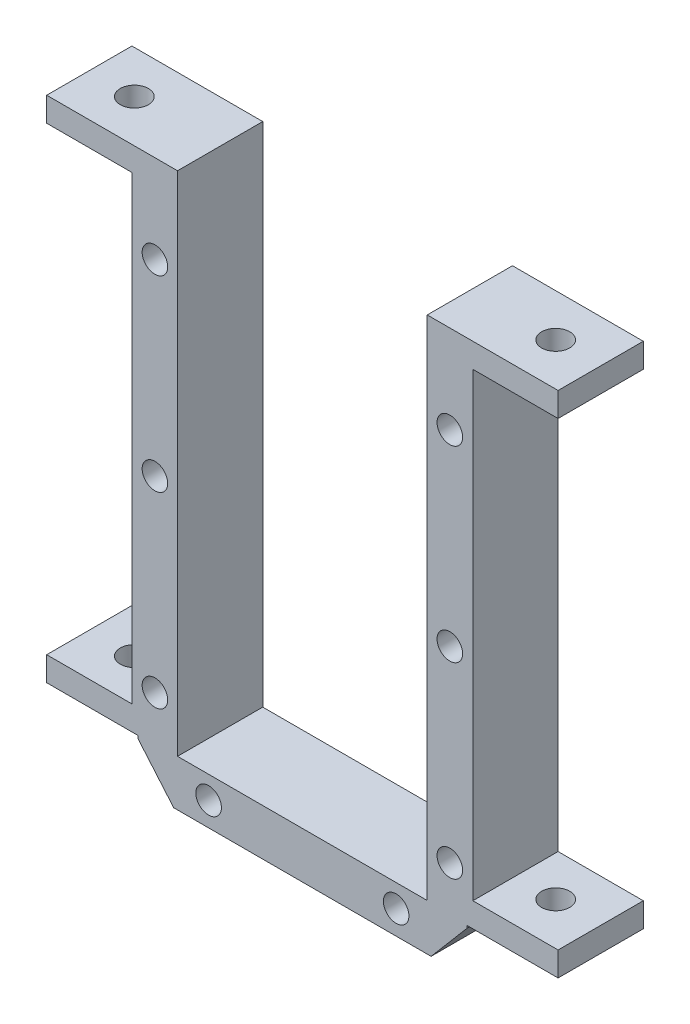
ISO-10303-21;
HEADER;
FILE_DESCRIPTION(('STEP AP214'),'2;1');
FILE_NAME('part.step','',(''),(''),'','','');
FILE_SCHEMA(('AUTOMOTIVE_DESIGN { 1 0 10303 214 1 1 1 1 }'));
ENDSEC;
DATA;
#1=APPLICATION_CONTEXT('core data for automotive mechanical design processes');
#2=APPLICATION_PROTOCOL_DEFINITION('international standard','automotive_design',2000,#1);
#3=PRODUCT_CONTEXT('',#1,'mechanical');
#4=PRODUCT('Part','Part','',(#3));
#5=PRODUCT_RELATED_PRODUCT_CATEGORY('part','',(#4));
#6=PRODUCT_DEFINITION_FORMATION('','',#4);
#7=PRODUCT_DEFINITION_CONTEXT('part definition',#1,'design');
#8=PRODUCT_DEFINITION('design','',#6,#7);
#9=PRODUCT_DEFINITION_SHAPE('','',#8);
#10=(LENGTH_UNIT() NAMED_UNIT(*) SI_UNIT(.MILLI.,.METRE.));
#11=(NAMED_UNIT(*) PLANE_ANGLE_UNIT() SI_UNIT($,.RADIAN.));
#12=(NAMED_UNIT(*) SI_UNIT($,.STERADIAN.) SOLID_ANGLE_UNIT());
#13=UNCERTAINTY_MEASURE_WITH_UNIT(LENGTH_MEASURE(1.E-05),#10,'distance_accuracy_value','');
#14=(GEOMETRIC_REPRESENTATION_CONTEXT(3) GLOBAL_UNCERTAINTY_ASSIGNED_CONTEXT((#13)) GLOBAL_UNIT_ASSIGNED_CONTEXT((#10,
#11,#12)) REPRESENTATION_CONTEXT('',''));
#15=CARTESIAN_POINT('',(0.,0.,0.));
#16=DIRECTION('',(0.,0.,1.));
#17=DIRECTION('',(1.,0.,0.));
#18=AXIS2_PLACEMENT_3D('',#15,#16,#17);
#19=CARTESIAN_POINT('',(-20.1,32.55,10.));
#20=DIRECTION('',(1.,0.,0.));
#21=DIRECTION('',(0.,1.,0.));
#22=AXIS2_PLACEMENT_3D('',#19,#20,#21);
#23=PLANE('',#22);
#24=DIRECTION('',(0.,0.,-1.));
#25=VECTOR('',#24,1.);
#26=CARTESIAN_POINT('',(-20.1,-24.45,0.));
#27=LINE('',#26,#25);
#28=CARTESIAN_POINT('',(-20.1,-24.45,10.));
#29=VERTEX_POINT('',#28);
#30=CARTESIAN_POINT('',(-20.1,-24.45,0.));
#31=VERTEX_POINT('',#30);
#32=EDGE_CURVE('E228',#29,#31,#27,.T.);
#33=ORIENTED_EDGE('',*,*,#32,.F.);
#34=DIRECTION('',(0.,-1.,0.));
#35=VECTOR('',#34,1.);
#36=CARTESIAN_POINT('',(-20.1,32.55,10.));
#37=LINE('',#36,#35);
#38=CARTESIAN_POINT('',(-20.1,29.55,10.));
#39=VERTEX_POINT('',#38);
#40=EDGE_CURVE('E337',#39,#29,#37,.T.);
#41=ORIENTED_EDGE('',*,*,#40,.F.);
#42=DIRECTION('',(0.,0.,1.));
#43=VECTOR('',#42,1.);
#44=CARTESIAN_POINT('',(-20.1,29.55,0.));
#45=LINE('',#44,#43);
#46=CARTESIAN_POINT('',(-20.1,29.55,0.));
#47=VERTEX_POINT('',#46);
#48=EDGE_CURVE('E226',#47,#39,#45,.T.);
#49=ORIENTED_EDGE('',*,*,#48,.F.);
#50=DIRECTION('',(0.,-1.,0.));
#51=VECTOR('',#50,1.);
#52=CARTESIAN_POINT('',(-20.1,32.55,0.));
#53=LINE('',#52,#51);
#54=EDGE_CURVE('E345',#47,#31,#53,.T.);
#55=ORIENTED_EDGE('',*,*,#54,.T.);
#56=EDGE_LOOP('',(#33,#41,#49,#55));
#57=FACE_BOUND('',#56,.T.);
#58=ADVANCED_FACE('F41',(#57),#23,.F.);
#59=CARTESIAN_POINT('',(19.9,32.55,10.));
#60=DIRECTION('',(-1.,0.,0.));
#61=DIRECTION('',(0.,-1.,0.));
#62=AXIS2_PLACEMENT_3D('',#59,#60,#61);
#63=PLANE('',#62);
#64=DIRECTION('',(0.,0.,1.));
#65=VECTOR('',#64,1.);
#66=CARTESIAN_POINT('',(19.9,-24.45,0.));
#67=LINE('',#66,#65);
#68=CARTESIAN_POINT('',(19.9,-24.45,0.));
#69=VERTEX_POINT('',#68);
#70=CARTESIAN_POINT('',(19.9,-24.45,9.99999999999999));
#71=VERTEX_POINT('',#70);
#72=EDGE_CURVE('E238',#69,#71,#67,.T.);
#73=ORIENTED_EDGE('',*,*,#72,.F.);
#74=DIRECTION('',(0.,1.,0.));
#75=VECTOR('',#74,1.);
#76=CARTESIAN_POINT('',(19.9,32.55,0.));
#77=LINE('',#76,#75);
#78=CARTESIAN_POINT('',(19.9,29.55,0.));
#79=VERTEX_POINT('',#78);
#80=EDGE_CURVE('E328',#69,#79,#77,.T.);
#81=ORIENTED_EDGE('',*,*,#80,.T.);
#82=DIRECTION('',(0.,0.,-1.));
#83=VECTOR('',#82,1.);
#84=CARTESIAN_POINT('',(19.9,29.55,0.));
#85=LINE('',#84,#83);
#86=CARTESIAN_POINT('',(19.9,29.55,10.));
#87=VERTEX_POINT('',#86);
#88=EDGE_CURVE('E240',#87,#79,#85,.T.);
#89=ORIENTED_EDGE('',*,*,#88,.F.);
#90=DIRECTION('',(0.,1.,0.));
#91=VECTOR('',#90,1.);
#92=CARTESIAN_POINT('',(19.9,32.55,10.));
#93=LINE('',#92,#91);
#94=EDGE_CURVE('E335',#71,#87,#93,.T.);
#95=ORIENTED_EDGE('',*,*,#94,.F.);
#96=EDGE_LOOP('',(#73,#81,#89,#95));
#97=FACE_BOUND('',#96,.T.);
#98=ADVANCED_FACE('F43',(#97),#63,.F.);
#99=CARTESIAN_POINT('',(-20.1,-32.55,10.));
#100=DIRECTION('',(0.,1.,0.));
#101=DIRECTION('',(0.,0.,1.));
#102=AXIS2_PLACEMENT_3D('',#99,#100,#101);
#103=PLANE('',#102);
#104=DIRECTION('',(1.,0.,0.));
#105=VECTOR('',#104,1.);
#106=CARTESIAN_POINT('',(-20.1,-32.55,0.));
#107=LINE('',#106,#105);
#108=CARTESIAN_POINT('',(-15.2,-32.55,0.));
#109=VERTEX_POINT('',#108);
#110=CARTESIAN_POINT('',(15.,-32.55,0.));
#111=VERTEX_POINT('',#110);
#112=EDGE_CURVE('E338',#109,#111,#107,.T.);
#113=ORIENTED_EDGE('',*,*,#112,.T.);
#114=DIRECTION('',(0.,0.,1.));
#115=VECTOR('',#114,1.);
#116=CARTESIAN_POINT('',(15.,-32.55,0.));
#117=LINE('',#116,#115);
#118=CARTESIAN_POINT('',(15.,-32.55,10.));
#119=VERTEX_POINT('',#118);
#120=EDGE_CURVE('E322',#111,#119,#117,.T.);
#121=ORIENTED_EDGE('',*,*,#120,.T.);
#122=DIRECTION('',(1.,0.,0.));
#123=VECTOR('',#122,1.);
#124=CARTESIAN_POINT('',(-20.1,-32.55,10.));
#125=LINE('',#124,#123);
#126=CARTESIAN_POINT('',(-15.2,-32.55,10.));
#127=VERTEX_POINT('',#126);
#128=EDGE_CURVE('E341',#127,#119,#125,.T.);
#129=ORIENTED_EDGE('',*,*,#128,.F.);
#130=DIRECTION('',(0.,0.,1.));
#131=VECTOR('',#130,1.);
#132=CARTESIAN_POINT('',(-15.2,-32.55,0.));
#133=LINE('',#132,#131);
#134=EDGE_CURVE('E316',#109,#127,#133,.T.);
#135=ORIENTED_EDGE('',*,*,#134,.F.);
#136=EDGE_LOOP('',(#113,#121,#129,#135));
#137=FACE_BOUND('',#136,.T.);
#138=ADVANCED_FACE('F386',(#137),#103,.F.);
#139=CARTESIAN_POINT('',(0.,0.,10.));
#140=DIRECTION('',(0.,0.,1.));
#141=DIRECTION('',(1.,0.,0.));
#142=AXIS2_PLACEMENT_3D('',#139,#140,#141);
#143=PLANE('',#142);
#144=DIRECTION('',(1.,0.,0.));
#145=VECTOR('',#144,1.);
#146=CARTESIAN_POINT('',(29.9,32.4,10.));
#147=LINE('',#146,#145);
#148=CARTESIAN_POINT('',(14.55,32.4,10.));
#149=VERTEX_POINT('',#148);
#150=CARTESIAN_POINT('',(29.9,32.4,10.));
#151=VERTEX_POINT('',#150);
#152=EDGE_CURVE('E56',#149,#151,#147,.T.);
#153=ORIENTED_EDGE('',*,*,#152,.F.);
#154=DIRECTION('',(0.,1.,0.));
#155=VECTOR('',#154,1.);
#156=CARTESIAN_POINT('',(14.55,-26.95,10.));
#157=LINE('',#156,#155);
#158=CARTESIAN_POINT('',(14.55,-27.1,10.));
#159=VERTEX_POINT('',#158);
#160=EDGE_CURVE('E313',#159,#149,#157,.T.);
#161=ORIENTED_EDGE('',*,*,#160,.F.);
#162=DIRECTION('',(1.,0.,0.));
#163=VECTOR('',#162,1.);
#164=CARTESIAN_POINT('',(-14.75,-27.1,10.));
#165=LINE('',#164,#163);
#166=CARTESIAN_POINT('',(-14.75,-27.1,10.));
#167=VERTEX_POINT('',#166);
#168=EDGE_CURVE('E201',#167,#159,#165,.T.);
#169=ORIENTED_EDGE('',*,*,#168,.F.);
#170=DIRECTION('',(0.,-1.,0.));
#171=VECTOR('',#170,1.);
#172=CARTESIAN_POINT('',(-14.75,32.55,10.));
#173=LINE('',#172,#171);
#174=CARTESIAN_POINT('',(-14.75,32.4,10.));
#175=VERTEX_POINT('',#174);
#176=EDGE_CURVE('E211',#175,#167,#173,.T.);
#177=ORIENTED_EDGE('',*,*,#176,.F.);
#178=DIRECTION('',(1.,0.,0.));
#179=VECTOR('',#178,1.);
#180=CARTESIAN_POINT('',(-30.1,32.4,10.));
#181=LINE('',#180,#179);
#182=CARTESIAN_POINT('',(-30.1,32.4,10.));
#183=VERTEX_POINT('',#182);
#184=EDGE_CURVE('E193',#183,#175,#181,.T.);
#185=ORIENTED_EDGE('',*,*,#184,.F.);
#186=DIRECTION('',(0.,1.,0.));
#187=VECTOR('',#186,1.);
#188=CARTESIAN_POINT('',(-30.1,29.55,10.));
#189=LINE('',#188,#187);
#190=CARTESIAN_POINT('',(-30.1,29.55,10.));
#191=VERTEX_POINT('',#190);
#192=EDGE_CURVE('E209',#191,#183,#189,.T.);
#193=ORIENTED_EDGE('',*,*,#192,.F.);
#194=DIRECTION('',(1.,0.,0.));
#195=VECTOR('',#194,1.);
#196=CARTESIAN_POINT('',(-30.1,29.55,10.));
#197=LINE('',#196,#195);
#198=EDGE_CURVE('E218',#191,#39,#197,.T.);
#199=ORIENTED_EDGE('',*,*,#198,.T.);
#200=ORIENTED_EDGE('',*,*,#40,.T.);
#201=DIRECTION('',(1.,0.,0.));
#202=VECTOR('',#201,1.);
#203=CARTESIAN_POINT('',(-30.1,-24.45,10.));
#204=LINE('',#203,#202);
#205=CARTESIAN_POINT('',(-30.1,-24.45,10.));
#206=VERTEX_POINT('',#205);
#207=EDGE_CURVE('E409',#206,#29,#204,.T.);
#208=ORIENTED_EDGE('',*,*,#207,.F.);
#209=DIRECTION('',(0.,1.,0.));
#210=VECTOR('',#209,1.);
#211=CARTESIAN_POINT('',(-30.1,-24.45,10.));
#212=LINE('',#211,#210);
#213=CARTESIAN_POINT('',(-30.1,-27.3,10.));
#214=VERTEX_POINT('',#213);
#215=EDGE_CURVE('E418',#214,#206,#212,.T.);
#216=ORIENTED_EDGE('',*,*,#215,.F.);
#217=DIRECTION('',(-1.,0.,0.));
#218=VECTOR('',#217,1.);
#219=CARTESIAN_POINT('',(-30.1,-27.3,10.));
#220=LINE('',#219,#218);
#221=CARTESIAN_POINT('',(-19.385,-27.3,10.));
#222=VERTEX_POINT('',#221);
#223=EDGE_CURVE('E436',#222,#214,#220,.T.);
#224=ORIENTED_EDGE('',*,*,#223,.F.);
#225=DIRECTION('',(0.,1.,0.));
#226=VECTOR('',#225,1.);
#227=CARTESIAN_POINT('',(-19.385,-27.3,10.));
#228=LINE('',#227,#226);
#229=CARTESIAN_POINT('',(-19.385,-27.6264705882353,10.));
#230=VERTEX_POINT('',#229);
#231=EDGE_CURVE('E451',#230,#222,#228,.T.);
#232=ORIENTED_EDGE('',*,*,#231,.F.);
#233=DIRECTION('',(-0.647648420095541,0.761939317759459,0.));
#234=VECTOR('',#233,1.);
#235=CARTESIAN_POINT('',(-15.2,-32.55,10.));
#236=LINE('',#235,#234);
#237=EDGE_CURVE('E325',#127,#230,#236,.T.);
#238=ORIENTED_EDGE('',*,*,#237,.F.);
#239=ORIENTED_EDGE('',*,*,#128,.T.);
#240=DIRECTION('',(-0.647648420095539,-0.76193931775946,0.));
#241=VECTOR('',#240,1.);
#242=CARTESIAN_POINT('',(15.,-32.55,10.));
#243=LINE('',#242,#241);
#244=CARTESIAN_POINT('',(19.185,-27.6264705882353,10.));
#245=VERTEX_POINT('',#244);
#246=EDGE_CURVE('E323',#245,#119,#243,.T.);
#247=ORIENTED_EDGE('',*,*,#246,.F.);
#248=DIRECTION('',(0.,-1.,0.));
#249=VECTOR('',#248,1.);
#250=CARTESIAN_POINT('',(19.185,-27.3,10.));
#251=LINE('',#250,#249);
#252=CARTESIAN_POINT('',(19.185,-27.3,10.));
#253=VERTEX_POINT('',#252);
#254=EDGE_CURVE('E380',#253,#245,#251,.T.);
#255=ORIENTED_EDGE('',*,*,#254,.F.);
#256=DIRECTION('',(-1.,0.,0.));
#257=VECTOR('',#256,1.);
#258=CARTESIAN_POINT('',(19.335,-27.3,10.));
#259=LINE('',#258,#257);
#260=CARTESIAN_POINT('',(29.9,-27.3,10.));
#261=VERTEX_POINT('',#260);
#262=EDGE_CURVE('E400',#261,#253,#259,.T.);
#263=ORIENTED_EDGE('',*,*,#262,.F.);
#264=DIRECTION('',(0.,-1.,0.));
#265=VECTOR('',#264,1.);
#266=CARTESIAN_POINT('',(29.9,-24.45,9.99999999999999));
#267=LINE('',#266,#265);
#268=CARTESIAN_POINT('',(29.9,-24.45,9.99999999999999));
#269=VERTEX_POINT('',#268);
#270=EDGE_CURVE('E241',#269,#261,#267,.T.);
#271=ORIENTED_EDGE('',*,*,#270,.F.);
#272=DIRECTION('',(-1.,0.,0.));
#273=VECTOR('',#272,1.);
#274=CARTESIAN_POINT('',(29.9,-24.45,9.99999999999999));
#275=LINE('',#274,#273);
#276=EDGE_CURVE('E234',#269,#71,#275,.T.);
#277=ORIENTED_EDGE('',*,*,#276,.T.);
#278=ORIENTED_EDGE('',*,*,#94,.T.);
#279=DIRECTION('',(-1.,0.,0.));
#280=VECTOR('',#279,1.);
#281=CARTESIAN_POINT('',(29.9,29.55,10.));
#282=LINE('',#281,#280);
#283=CARTESIAN_POINT('',(29.9,29.55,10.));
#284=VERTEX_POINT('',#283);
#285=EDGE_CURVE('E259',#284,#87,#282,.T.);
#286=ORIENTED_EDGE('',*,*,#285,.F.);
#287=DIRECTION('',(0.,-1.,0.));
#288=VECTOR('',#287,1.);
#289=CARTESIAN_POINT('',(29.9,29.55,10.));
#290=LINE('',#289,#288);
#291=EDGE_CURVE('E250',#151,#284,#290,.T.);
#292=ORIENTED_EDGE('',*,*,#291,.F.);
#293=EDGE_LOOP('',(#153,#161,#169,#177,#185,#193,#199,#200,#208,#216,#224,#232,#238,#239,#247,
#255,#263,#271,#277,#278,#286,#292));
#294=FACE_BOUND('',#293,.T.);
#295=CARTESIAN_POINT('',(17.2,22.05,10.));
#296=DIRECTION('',(0.,0.,1.));
#297=DIRECTION('',(-1.,0.,0.));
#298=AXIS2_PLACEMENT_3D('',#295,#296,#297);
#299=CIRCLE('',#298,1.5);
#300=CARTESIAN_POINT('',(15.7,22.05,10.));
#301=VERTEX_POINT('',#300);
#302=EDGE_CURVE('E300',#301,#301,#299,.T.);
#303=ORIENTED_EDGE('',*,*,#302,.F.);
#304=EDGE_LOOP('',(#303));
#305=FACE_BOUND('',#304,.T.);
#306=CARTESIAN_POINT('',(17.2,0.0500000000000265,10.));
#307=DIRECTION('',(0.,0.,1.));
#308=DIRECTION('',(-1.,0.,0.));
#309=AXIS2_PLACEMENT_3D('',#306,#307,#308);
#310=CIRCLE('',#309,1.5);
#311=CARTESIAN_POINT('',(15.7,0.0500000000000265,10.));
#312=VERTEX_POINT('',#311);
#313=EDGE_CURVE('E294',#312,#312,#310,.T.);
#314=ORIENTED_EDGE('',*,*,#313,.F.);
#315=EDGE_LOOP('',(#314));
#316=FACE_BOUND('',#315,.T.);
#317=CARTESIAN_POINT('',(17.2,-21.95,10.));
#318=DIRECTION('',(0.,0.,1.));
#319=DIRECTION('',(-1.,0.,0.));
#320=AXIS2_PLACEMENT_3D('',#317,#318,#319);
#321=CIRCLE('',#320,1.5);
#322=CARTESIAN_POINT('',(15.7,-21.95,10.));
#323=VERTEX_POINT('',#322);
#324=EDGE_CURVE('E288',#323,#323,#321,.T.);
#325=ORIENTED_EDGE('',*,*,#324,.F.);
#326=EDGE_LOOP('',(#325));
#327=FACE_BOUND('',#326,.T.);
#328=CARTESIAN_POINT('',(10.9,-29.75,10.));
#329=DIRECTION('',(0.,0.,1.));
#330=DIRECTION('',(-1.,0.,0.));
#331=AXIS2_PLACEMENT_3D('',#328,#329,#330);
#332=CIRCLE('',#331,1.5);
#333=CARTESIAN_POINT('',(9.40000000000001,-29.75,10.));
#334=VERTEX_POINT('',#333);
#335=EDGE_CURVE('E282',#334,#334,#332,.T.);
#336=ORIENTED_EDGE('',*,*,#335,.F.);
#337=EDGE_LOOP('',(#336));
#338=FACE_BOUND('',#337,.T.);
#339=CARTESIAN_POINT('',(-11.1,-29.75,10.));
#340=DIRECTION('',(0.,0.,1.));
#341=DIRECTION('',(1.,0.,0.));
#342=AXIS2_PLACEMENT_3D('',#339,#340,#341);
#343=CIRCLE('',#342,1.5);
#344=CARTESIAN_POINT('',(-9.6,-29.75,10.));
#345=VERTEX_POINT('',#344);
#346=EDGE_CURVE('E276',#345,#345,#343,.T.);
#347=ORIENTED_EDGE('',*,*,#346,.F.);
#348=EDGE_LOOP('',(#347));
#349=FACE_BOUND('',#348,.T.);
#350=CARTESIAN_POINT('',(-17.4,-21.95,10.));
#351=DIRECTION('',(0.,0.,1.));
#352=DIRECTION('',(1.,0.,0.));
#353=AXIS2_PLACEMENT_3D('',#350,#351,#352);
#354=CIRCLE('',#353,1.5);
#355=CARTESIAN_POINT('',(-15.9,-21.95,10.));
#356=VERTEX_POINT('',#355);
#357=EDGE_CURVE('E270',#356,#356,#354,.T.);
#358=ORIENTED_EDGE('',*,*,#357,.F.);
#359=EDGE_LOOP('',(#358));
#360=FACE_BOUND('',#359,.T.);
#361=CARTESIAN_POINT('',(-17.4,0.0500000000000222,10.));
#362=DIRECTION('',(0.,0.,1.));
#363=DIRECTION('',(1.,0.,0.));
#364=AXIS2_PLACEMENT_3D('',#361,#362,#363);
#365=CIRCLE('',#364,1.5);
#366=CARTESIAN_POINT('',(-15.9,0.0500000000000222,10.));
#367=VERTEX_POINT('',#366);
#368=EDGE_CURVE('E263',#367,#367,#365,.T.);
#369=ORIENTED_EDGE('',*,*,#368,.F.);
#370=EDGE_LOOP('',(#369));
#371=FACE_BOUND('',#370,.T.);
#372=CARTESIAN_POINT('',(-17.4,22.05,10.));
#373=DIRECTION('',(0.,0.,1.));
#374=DIRECTION('',(1.,0.,0.));
#375=AXIS2_PLACEMENT_3D('',#372,#373,#374);
#376=CIRCLE('',#375,1.5);
#377=CARTESIAN_POINT('',(-15.9,22.05,10.));
#378=VERTEX_POINT('',#377);
#379=EDGE_CURVE('E266',#378,#378,#376,.T.);
#380=ORIENTED_EDGE('',*,*,#379,.F.);
#381=EDGE_LOOP('',(#380));
#382=FACE_BOUND('',#381,.T.);
#383=ADVANCED_FACE('F206',(#294,#305,#316,#327,#338,#349,#360,#371,#382),#143,.T.);
#384=CARTESIAN_POINT('',(0.,0.,0.));
#385=DIRECTION('',(0.,0.,1.));
#386=DIRECTION('',(1.,0.,0.));
#387=AXIS2_PLACEMENT_3D('',#384,#385,#386);
#388=PLANE('',#387);
#389=DIRECTION('',(0.,1.,0.));
#390=VECTOR('',#389,1.);
#391=CARTESIAN_POINT('',(14.55,-26.95,0.));
#392=LINE('',#391,#390);
#393=CARTESIAN_POINT('',(14.55,-27.1,0.));
#394=VERTEX_POINT('',#393);
#395=CARTESIAN_POINT('',(14.55,32.4,0.));
#396=VERTEX_POINT('',#395);
#397=EDGE_CURVE('E312',#394,#396,#392,.T.);
#398=ORIENTED_EDGE('',*,*,#397,.T.);
#399=DIRECTION('',(1.,0.,0.));
#400=VECTOR('',#399,1.);
#401=CARTESIAN_POINT('',(29.9,32.4,0.));
#402=LINE('',#401,#400);
#403=CARTESIAN_POINT('',(29.9,32.4,0.));
#404=VERTEX_POINT('',#403);
#405=EDGE_CURVE('E874',#396,#404,#402,.T.);
#406=ORIENTED_EDGE('',*,*,#405,.T.);
#407=DIRECTION('',(0.,1.,0.));
#408=VECTOR('',#407,1.);
#409=CARTESIAN_POINT('',(29.9,32.55,0.));
#410=LINE('',#409,#408);
#411=CARTESIAN_POINT('',(29.9,29.55,0.));
#412=VERTEX_POINT('',#411);
#413=EDGE_CURVE('E247',#412,#404,#410,.T.);
#414=ORIENTED_EDGE('',*,*,#413,.F.);
#415=DIRECTION('',(-1.,0.,0.));
#416=VECTOR('',#415,1.);
#417=CARTESIAN_POINT('',(29.9,29.55,0.));
#418=LINE('',#417,#416);
#419=EDGE_CURVE('E254',#412,#79,#418,.T.);
#420=ORIENTED_EDGE('',*,*,#419,.T.);
#421=ORIENTED_EDGE('',*,*,#80,.F.);
#422=DIRECTION('',(-1.,0.,0.));
#423=VECTOR('',#422,1.);
#424=CARTESIAN_POINT('',(29.9,-24.45,0.));
#425=LINE('',#424,#423);
#426=CARTESIAN_POINT('',(29.9,-24.45,0.));
#427=VERTEX_POINT('',#426);
#428=EDGE_CURVE('E232',#427,#69,#425,.T.);
#429=ORIENTED_EDGE('',*,*,#428,.F.);
#430=DIRECTION('',(0.,1.,0.));
#431=VECTOR('',#430,1.);
#432=CARTESIAN_POINT('',(29.9,-27.45,0.));
#433=LINE('',#432,#431);
#434=CARTESIAN_POINT('',(29.9,-27.3,0.));
#435=VERTEX_POINT('',#434);
#436=EDGE_CURVE('E243',#435,#427,#433,.T.);
#437=ORIENTED_EDGE('',*,*,#436,.F.);
#438=DIRECTION('',(-1.,0.,0.));
#439=VECTOR('',#438,1.);
#440=CARTESIAN_POINT('',(29.9,-27.3,0.));
#441=LINE('',#440,#439);
#442=CARTESIAN_POINT('',(19.185,-27.3,0.));
#443=VERTEX_POINT('',#442);
#444=EDGE_CURVE('E64',#435,#443,#441,.T.);
#445=ORIENTED_EDGE('',*,*,#444,.T.);
#446=DIRECTION('',(0.,-1.,0.));
#447=VECTOR('',#446,1.);
#448=CARTESIAN_POINT('',(19.185,-27.3,0.));
#449=LINE('',#448,#447);
#450=CARTESIAN_POINT('',(19.185,-27.6264705882353,0.));
#451=VERTEX_POINT('',#450);
#452=EDGE_CURVE('E392',#443,#451,#449,.T.);
#453=ORIENTED_EDGE('',*,*,#452,.T.);
#454=DIRECTION('',(-0.647648420095539,-0.76193931775946,0.));
#455=VECTOR('',#454,1.);
#456=CARTESIAN_POINT('',(15.,-32.55,0.));
#457=LINE('',#456,#455);
#458=EDGE_CURVE('E320',#451,#111,#457,.T.);
#459=ORIENTED_EDGE('',*,*,#458,.T.);
#460=ORIENTED_EDGE('',*,*,#112,.F.);
#461=DIRECTION('',(-0.647648420095541,0.761939317759459,0.));
#462=VECTOR('',#461,1.);
#463=CARTESIAN_POINT('',(-15.2,-32.55,0.));
#464=LINE('',#463,#462);
#465=CARTESIAN_POINT('',(-19.385,-27.6264705882353,0.));
#466=VERTEX_POINT('',#465);
#467=EDGE_CURVE('E330',#109,#466,#464,.T.);
#468=ORIENTED_EDGE('',*,*,#467,.T.);
#469=DIRECTION('',(0.,1.,0.));
#470=VECTOR('',#469,1.);
#471=CARTESIAN_POINT('',(-19.385,-27.3,0.));
#472=LINE('',#471,#470);
#473=CARTESIAN_POINT('',(-19.385,-27.3,0.));
#474=VERTEX_POINT('',#473);
#475=EDGE_CURVE('E452',#466,#474,#472,.T.);
#476=ORIENTED_EDGE('',*,*,#475,.T.);
#477=DIRECTION('',(-1.,0.,0.));
#478=VECTOR('',#477,1.);
#479=CARTESIAN_POINT('',(-19.535,-27.3,0.));
#480=LINE('',#479,#478);
#481=CARTESIAN_POINT('',(-30.1,-27.3,0.));
#482=VERTEX_POINT('',#481);
#483=EDGE_CURVE('E446',#474,#482,#480,.T.);
#484=ORIENTED_EDGE('',*,*,#483,.T.);
#485=DIRECTION('',(0.,-1.,0.));
#486=VECTOR('',#485,1.);
#487=CARTESIAN_POINT('',(-30.1,-27.45,0.));
#488=LINE('',#487,#486);
#489=CARTESIAN_POINT('',(-30.1,-24.45,0.));
#490=VERTEX_POINT('',#489);
#491=EDGE_CURVE('E415',#490,#482,#488,.T.);
#492=ORIENTED_EDGE('',*,*,#491,.F.);
#493=DIRECTION('',(1.,0.,0.));
#494=VECTOR('',#493,1.);
#495=CARTESIAN_POINT('',(-30.1,-24.45,0.));
#496=LINE('',#495,#494);
#497=EDGE_CURVE('E412',#490,#31,#496,.T.);
#498=ORIENTED_EDGE('',*,*,#497,.T.);
#499=ORIENTED_EDGE('',*,*,#54,.F.);
#500=DIRECTION('',(1.,0.,0.));
#501=VECTOR('',#500,1.);
#502=CARTESIAN_POINT('',(-30.1,29.55,0.));
#503=LINE('',#502,#501);
#504=CARTESIAN_POINT('',(-30.1,29.55,0.));
#505=VERTEX_POINT('',#504);
#506=EDGE_CURVE('E220',#505,#47,#503,.T.);
#507=ORIENTED_EDGE('',*,*,#506,.F.);
#508=DIRECTION('',(0.,-1.,0.));
#509=VECTOR('',#508,1.);
#510=CARTESIAN_POINT('',(-30.1,32.55,0.));
#511=LINE('',#510,#509);
#512=CARTESIAN_POINT('',(-30.1,32.4,0.));
#513=VERTEX_POINT('',#512);
#514=EDGE_CURVE('E222',#513,#505,#511,.T.);
#515=ORIENTED_EDGE('',*,*,#514,.F.);
#516=DIRECTION('',(1.,0.,0.));
#517=VECTOR('',#516,1.);
#518=CARTESIAN_POINT('',(-30.1,32.4,0.));
#519=LINE('',#518,#517);
#520=CARTESIAN_POINT('',(-14.75,32.4,0.));
#521=VERTEX_POINT('',#520);
#522=EDGE_CURVE('E196',#513,#521,#519,.T.);
#523=ORIENTED_EDGE('',*,*,#522,.T.);
#524=DIRECTION('',(0.,-1.,0.));
#525=VECTOR('',#524,1.);
#526=CARTESIAN_POINT('',(-14.75,32.55,0.));
#527=LINE('',#526,#525);
#528=CARTESIAN_POINT('',(-14.75,-27.1,0.));
#529=VERTEX_POINT('',#528);
#530=EDGE_CURVE('E310',#521,#529,#527,.T.);
#531=ORIENTED_EDGE('',*,*,#530,.T.);
#532=DIRECTION('',(1.,0.,0.));
#533=VECTOR('',#532,1.);
#534=CARTESIAN_POINT('',(-14.75,-27.1,0.));
#535=LINE('',#534,#533);
#536=EDGE_CURVE('E897',#529,#394,#535,.T.);
#537=ORIENTED_EDGE('',*,*,#536,.T.);
#538=EDGE_LOOP('',(#398,#406,#414,#420,#421,#429,#437,#445,#453,#459,#460,#468,#476,#484,#492,
#498,#499,#507,#515,#523,#531,#537));
#539=FACE_BOUND('',#538,.T.);
#540=CARTESIAN_POINT('',(17.2,22.05,0.));
#541=DIRECTION('',(0.,0.,1.));
#542=DIRECTION('',(-1.,0.,0.));
#543=AXIS2_PLACEMENT_3D('',#540,#541,#542);
#544=CIRCLE('',#543,1.5);
#545=CARTESIAN_POINT('',(15.7,22.05,0.));
#546=VERTEX_POINT('',#545);
#547=EDGE_CURVE('E262',#546,#546,#544,.T.);
#548=ORIENTED_EDGE('',*,*,#547,.T.);
#549=EDGE_LOOP('',(#548));
#550=FACE_BOUND('',#549,.T.);
#551=CARTESIAN_POINT('',(17.2,0.0500000000000265,0.));
#552=DIRECTION('',(0.,0.,1.));
#553=DIRECTION('',(-1.,0.,0.));
#554=AXIS2_PLACEMENT_3D('',#551,#552,#553);
#555=CIRCLE('',#554,1.5);
#556=CARTESIAN_POINT('',(15.7,0.0500000000000265,0.));
#557=VERTEX_POINT('',#556);
#558=EDGE_CURVE('E297',#557,#557,#555,.T.);
#559=ORIENTED_EDGE('',*,*,#558,.T.);
#560=EDGE_LOOP('',(#559));
#561=FACE_BOUND('',#560,.T.);
#562=CARTESIAN_POINT('',(17.2,-21.95,0.));
#563=DIRECTION('',(0.,0.,1.));
#564=DIRECTION('',(-1.,0.,0.));
#565=AXIS2_PLACEMENT_3D('',#562,#563,#564);
#566=CIRCLE('',#565,1.5);
#567=CARTESIAN_POINT('',(15.7,-21.95,0.));
#568=VERTEX_POINT('',#567);
#569=EDGE_CURVE('E291',#568,#568,#566,.T.);
#570=ORIENTED_EDGE('',*,*,#569,.T.);
#571=EDGE_LOOP('',(#570));
#572=FACE_BOUND('',#571,.T.);
#573=CARTESIAN_POINT('',(10.9,-29.75,0.));
#574=DIRECTION('',(0.,0.,1.));
#575=DIRECTION('',(-1.,0.,0.));
#576=AXIS2_PLACEMENT_3D('',#573,#574,#575);
#577=CIRCLE('',#576,1.5);
#578=CARTESIAN_POINT('',(9.40000000000001,-29.75,0.));
#579=VERTEX_POINT('',#578);
#580=EDGE_CURVE('E285',#579,#579,#577,.T.);
#581=ORIENTED_EDGE('',*,*,#580,.T.);
#582=EDGE_LOOP('',(#581));
#583=FACE_BOUND('',#582,.T.);
#584=CARTESIAN_POINT('',(-11.1,-29.75,0.));
#585=DIRECTION('',(0.,0.,1.));
#586=DIRECTION('',(1.,0.,0.));
#587=AXIS2_PLACEMENT_3D('',#584,#585,#586);
#588=CIRCLE('',#587,1.5);
#589=CARTESIAN_POINT('',(-9.6,-29.75,0.));
#590=VERTEX_POINT('',#589);
#591=EDGE_CURVE('E279',#590,#590,#588,.T.);
#592=ORIENTED_EDGE('',*,*,#591,.T.);
#593=EDGE_LOOP('',(#592));
#594=FACE_BOUND('',#593,.T.);
#595=CARTESIAN_POINT('',(-17.4,-21.95,0.));
#596=DIRECTION('',(0.,0.,1.));
#597=DIRECTION('',(1.,0.,0.));
#598=AXIS2_PLACEMENT_3D('',#595,#596,#597);
#599=CIRCLE('',#598,1.5);
#600=CARTESIAN_POINT('',(-15.9,-21.95,0.));
#601=VERTEX_POINT('',#600);
#602=EDGE_CURVE('E273',#601,#601,#599,.T.);
#603=ORIENTED_EDGE('',*,*,#602,.T.);
#604=EDGE_LOOP('',(#603));
#605=FACE_BOUND('',#604,.T.);
#606=CARTESIAN_POINT('',(-17.4,0.0500000000000222,0.));
#607=DIRECTION('',(0.,0.,1.));
#608=DIRECTION('',(1.,0.,0.));
#609=AXIS2_PLACEMENT_3D('',#606,#607,#608);
#610=CIRCLE('',#609,1.5);
#611=CARTESIAN_POINT('',(-15.9,0.0500000000000222,0.));
#612=VERTEX_POINT('',#611);
#613=EDGE_CURVE('E267',#612,#612,#610,.T.);
#614=ORIENTED_EDGE('',*,*,#613,.T.);
#615=EDGE_LOOP('',(#614));
#616=FACE_BOUND('',#615,.T.);
#617=CARTESIAN_POINT('',(-17.4,22.05,0.));
#618=DIRECTION('',(0.,0.,1.));
#619=DIRECTION('',(1.,0.,0.));
#620=AXIS2_PLACEMENT_3D('',#617,#618,#619);
#621=CIRCLE('',#620,1.5);
#622=CARTESIAN_POINT('',(-15.9,22.05,0.));
#623=VERTEX_POINT('',#622);
#624=EDGE_CURVE('E305',#623,#623,#621,.T.);
#625=ORIENTED_EDGE('',*,*,#624,.T.);
#626=EDGE_LOOP('',(#625));
#627=FACE_BOUND('',#626,.T.);
#628=ADVANCED_FACE('F389',(#539,#550,#561,#572,#583,#594,#605,#616,#627),#388,.F.);
#629=CARTESIAN_POINT('',(-15.2,-32.55,0.));
#630=DIRECTION('',(0.761939317759459,0.647648420095541,0.));
#631=DIRECTION('',(-0.647648420095541,0.761939317759459,0.));
#632=AXIS2_PLACEMENT_3D('',#629,#630,#631);
#633=PLANE('',#632);
#634=ORIENTED_EDGE('',*,*,#237,.T.);
#635=DIRECTION('',(0.,0.,-1.));
#636=VECTOR('',#635,1.);
#637=CARTESIAN_POINT('',(-19.385,-27.6264705882353,0.));
#638=LINE('',#637,#636);
#639=EDGE_CURVE('E11',#230,#466,#638,.T.);
#640=ORIENTED_EDGE('',*,*,#639,.T.);
#641=ORIENTED_EDGE('',*,*,#467,.F.);
#642=ORIENTED_EDGE('',*,*,#134,.T.);
#643=EDGE_LOOP('',(#634,#640,#641,#642));
#644=FACE_BOUND('',#643,.T.);
#645=ADVANCED_FACE('F458',(#644),#633,.F.);
#646=CARTESIAN_POINT('',(15.,-32.55,0.));
#647=DIRECTION('',(-0.76193931775946,0.647648420095539,0.));
#648=DIRECTION('',(-0.647648420095539,-0.76193931775946,0.));
#649=AXIS2_PLACEMENT_3D('',#646,#647,#648);
#650=PLANE('',#649);
#651=ORIENTED_EDGE('',*,*,#458,.F.);
#652=DIRECTION('',(0.,0.,1.));
#653=VECTOR('',#652,1.);
#654=CARTESIAN_POINT('',(19.185,-27.6264705882353,0.));
#655=LINE('',#654,#653);
#656=EDGE_CURVE('E49',#451,#245,#655,.T.);
#657=ORIENTED_EDGE('',*,*,#656,.T.);
#658=ORIENTED_EDGE('',*,*,#246,.T.);
#659=ORIENTED_EDGE('',*,*,#120,.F.);
#660=EDGE_LOOP('',(#651,#657,#658,#659));
#661=FACE_BOUND('',#660,.T.);
#662=ADVANCED_FACE('F373',(#661),#650,.F.);
#663=CARTESIAN_POINT('',(14.55,-26.95,0.));
#664=DIRECTION('',(1.,0.,0.));
#665=DIRECTION('',(0.,1.,0.));
#666=AXIS2_PLACEMENT_3D('',#663,#664,#665);
#667=PLANE('',#666);
#668=ORIENTED_EDGE('',*,*,#160,.T.);
#669=DIRECTION('',(0.,0.,1.));
#670=VECTOR('',#669,1.);
#671=CARTESIAN_POINT('',(14.55,32.4,0.));
#672=LINE('',#671,#670);
#673=EDGE_CURVE('E888',#396,#149,#672,.T.);
#674=ORIENTED_EDGE('',*,*,#673,.F.);
#675=ORIENTED_EDGE('',*,*,#397,.F.);
#676=DIRECTION('',(0.,0.,1.));
#677=VECTOR('',#676,1.);
#678=CARTESIAN_POINT('',(14.55,-27.1,0.));
#679=LINE('',#678,#677);
#680=EDGE_CURVE('E890',#394,#159,#679,.T.);
#681=ORIENTED_EDGE('',*,*,#680,.T.);
#682=EDGE_LOOP('',(#668,#674,#675,#681));
#683=FACE_BOUND('',#682,.T.);
#684=ADVANCED_FACE('F465',(#683),#667,.F.);
#685=CARTESIAN_POINT('',(-14.75,32.55,0.));
#686=DIRECTION('',(-1.,0.,0.));
#687=DIRECTION('',(0.,0.,1.));
#688=AXIS2_PLACEMENT_3D('',#685,#686,#687);
#689=PLANE('',#688);
#690=ORIENTED_EDGE('',*,*,#530,.F.);
#691=DIRECTION('',(0.,0.,1.));
#692=VECTOR('',#691,1.);
#693=CARTESIAN_POINT('',(-14.75,32.4,0.));
#694=LINE('',#693,#692);
#695=EDGE_CURVE('E200',#521,#175,#694,.T.);
#696=ORIENTED_EDGE('',*,*,#695,.T.);
#697=ORIENTED_EDGE('',*,*,#176,.T.);
#698=DIRECTION('',(0.,0.,1.));
#699=VECTOR('',#698,1.);
#700=CARTESIAN_POINT('',(-14.75,-27.1,0.));
#701=LINE('',#700,#699);
#702=EDGE_CURVE('E893',#529,#167,#701,.T.);
#703=ORIENTED_EDGE('',*,*,#702,.F.);
#704=EDGE_LOOP('',(#690,#696,#697,#703));
#705=FACE_BOUND('',#704,.T.);
#706=ADVANCED_FACE('F579',(#705),#689,.F.);
#707=CARTESIAN_POINT('',(-17.4,22.05,0.));
#708=DIRECTION('',(0.,0.,1.));
#709=DIRECTION('',(1.,0.,0.));
#710=AXIS2_PLACEMENT_3D('',#707,#708,#709);
#711=CYLINDRICAL_SURFACE('',#710,1.5);
#712=ORIENTED_EDGE('',*,*,#624,.F.);
#713=EDGE_LOOP('',(#712));
#714=FACE_BOUND('',#713,.T.);
#715=ORIENTED_EDGE('',*,*,#379,.T.);
#716=EDGE_LOOP('',(#715));
#717=FACE_BOUND('',#716,.T.);
#718=ADVANCED_FACE('F592',(#714,#717),#711,.F.);
#719=CARTESIAN_POINT('',(-17.4,0.0500000000000222,0.));
#720=DIRECTION('',(0.,0.,1.));
#721=DIRECTION('',(1.,0.,0.));
#722=AXIS2_PLACEMENT_3D('',#719,#720,#721);
#723=CYLINDRICAL_SURFACE('',#722,1.5);
#724=ORIENTED_EDGE('',*,*,#613,.F.);
#725=EDGE_LOOP('',(#724));
#726=FACE_BOUND('',#725,.T.);
#727=ORIENTED_EDGE('',*,*,#368,.T.);
#728=EDGE_LOOP('',(#727));
#729=FACE_BOUND('',#728,.T.);
#730=ADVANCED_FACE('F678',(#726,#729),#723,.F.);
#731=CARTESIAN_POINT('',(-17.4,-21.95,0.));
#732=DIRECTION('',(0.,0.,1.));
#733=DIRECTION('',(1.,0.,0.));
#734=AXIS2_PLACEMENT_3D('',#731,#732,#733);
#735=CYLINDRICAL_SURFACE('',#734,1.5);
#736=ORIENTED_EDGE('',*,*,#602,.F.);
#737=EDGE_LOOP('',(#736));
#738=FACE_BOUND('',#737,.T.);
#739=ORIENTED_EDGE('',*,*,#357,.T.);
#740=EDGE_LOOP('',(#739));
#741=FACE_BOUND('',#740,.T.);
#742=ADVANCED_FACE('F681',(#738,#741),#735,.F.);
#743=CARTESIAN_POINT('',(-11.1,-29.75,0.));
#744=DIRECTION('',(0.,0.,1.));
#745=DIRECTION('',(1.,0.,0.));
#746=AXIS2_PLACEMENT_3D('',#743,#744,#745);
#747=CYLINDRICAL_SURFACE('',#746,1.5);
#748=ORIENTED_EDGE('',*,*,#591,.F.);
#749=EDGE_LOOP('',(#748));
#750=FACE_BOUND('',#749,.T.);
#751=ORIENTED_EDGE('',*,*,#346,.T.);
#752=EDGE_LOOP('',(#751));
#753=FACE_BOUND('',#752,.T.);
#754=ADVANCED_FACE('F685',(#750,#753),#747,.F.);
#755=CARTESIAN_POINT('',(10.9,-29.75,0.));
#756=DIRECTION('',(0.,0.,1.));
#757=DIRECTION('',(1.,0.,0.));
#758=AXIS2_PLACEMENT_3D('',#755,#756,#757);
#759=CYLINDRICAL_SURFACE('',#758,1.5);
#760=ORIENTED_EDGE('',*,*,#580,.F.);
#761=EDGE_LOOP('',(#760));
#762=FACE_BOUND('',#761,.T.);
#763=ORIENTED_EDGE('',*,*,#335,.T.);
#764=EDGE_LOOP('',(#763));
#765=FACE_BOUND('',#764,.T.);
#766=ADVANCED_FACE('F689',(#762,#765),#759,.F.);
#767=CARTESIAN_POINT('',(17.2,-21.95,0.));
#768=DIRECTION('',(0.,0.,1.));
#769=DIRECTION('',(1.,0.,0.));
#770=AXIS2_PLACEMENT_3D('',#767,#768,#769);
#771=CYLINDRICAL_SURFACE('',#770,1.5);
#772=ORIENTED_EDGE('',*,*,#569,.F.);
#773=EDGE_LOOP('',(#772));
#774=FACE_BOUND('',#773,.T.);
#775=ORIENTED_EDGE('',*,*,#324,.T.);
#776=EDGE_LOOP('',(#775));
#777=FACE_BOUND('',#776,.T.);
#778=ADVANCED_FACE('F693',(#774,#777),#771,.F.);
#779=CARTESIAN_POINT('',(17.2,0.0500000000000265,0.));
#780=DIRECTION('',(0.,0.,1.));
#781=DIRECTION('',(1.,0.,0.));
#782=AXIS2_PLACEMENT_3D('',#779,#780,#781);
#783=CYLINDRICAL_SURFACE('',#782,1.5);
#784=ORIENTED_EDGE('',*,*,#558,.F.);
#785=EDGE_LOOP('',(#784));
#786=FACE_BOUND('',#785,.T.);
#787=ORIENTED_EDGE('',*,*,#313,.T.);
#788=EDGE_LOOP('',(#787));
#789=FACE_BOUND('',#788,.T.);
#790=ADVANCED_FACE('F697',(#786,#789),#783,.F.);
#791=CARTESIAN_POINT('',(17.2,22.05,0.));
#792=DIRECTION('',(0.,0.,1.));
#793=DIRECTION('',(1.,0.,0.));
#794=AXIS2_PLACEMENT_3D('',#791,#792,#793);
#795=CYLINDRICAL_SURFACE('',#794,1.5);
#796=ORIENTED_EDGE('',*,*,#547,.F.);
#797=EDGE_LOOP('',(#796));
#798=FACE_BOUND('',#797,.T.);
#799=ORIENTED_EDGE('',*,*,#302,.T.);
#800=EDGE_LOOP('',(#799));
#801=FACE_BOUND('',#800,.T.);
#802=ADVANCED_FACE('F676',(#798,#801),#795,.F.);
#803=CARTESIAN_POINT('',(29.9,29.55,0.));
#804=DIRECTION('',(0.,1.,0.));
#805=DIRECTION('',(-1.,0.,0.));
#806=AXIS2_PLACEMENT_3D('',#803,#804,#805);
#807=PLANE('',#806);
#808=CARTESIAN_POINT('',(24.6175,29.55,5.));
#809=DIRECTION('',(0.,1.,0.));
#810=DIRECTION('',(-1.,0.,0.));
#811=AXIS2_PLACEMENT_3D('',#808,#809,#810);
#812=CIRCLE('',#811,1.65);
#813=CARTESIAN_POINT('',(22.9675,29.55,5.));
#814=VERTEX_POINT('',#813);
#815=EDGE_CURVE('E353',#814,#814,#812,.T.);
#816=ORIENTED_EDGE('',*,*,#815,.T.);
#817=EDGE_LOOP('',(#816));
#818=FACE_BOUND('',#817,.T.);
#819=ORIENTED_EDGE('',*,*,#88,.T.);
#820=ORIENTED_EDGE('',*,*,#419,.F.);
#821=DIRECTION('',(0.,0.,-1.));
#822=VECTOR('',#821,1.);
#823=CARTESIAN_POINT('',(29.9,29.55,0.));
#824=LINE('',#823,#822);
#825=EDGE_CURVE('E252',#284,#412,#824,.T.);
#826=ORIENTED_EDGE('',*,*,#825,.F.);
#827=ORIENTED_EDGE('',*,*,#285,.T.);
#828=EDGE_LOOP('',(#819,#820,#826,#827));
#829=FACE_BOUND('',#828,.T.);
#830=ADVANCED_FACE('F673',(#818,#829),#807,.F.);
#831=CARTESIAN_POINT('',(29.9,0.,0.));
#832=DIRECTION('',(-1.,0.,0.));
#833=DIRECTION('',(0.,-1.,0.));
#834=AXIS2_PLACEMENT_3D('',#831,#832,#833);
#835=PLANE('',#834);
#836=ORIENTED_EDGE('',*,*,#413,.T.);
#837=DIRECTION('',(0.,0.,1.));
#838=VECTOR('',#837,1.);
#839=CARTESIAN_POINT('',(29.9,32.4,0.));
#840=LINE('',#839,#838);
#841=EDGE_CURVE('E454',#404,#151,#840,.T.);
#842=ORIENTED_EDGE('',*,*,#841,.T.);
#843=ORIENTED_EDGE('',*,*,#291,.T.);
#844=ORIENTED_EDGE('',*,*,#825,.T.);
#845=EDGE_LOOP('',(#836,#842,#843,#844));
#846=FACE_BOUND('',#845,.T.);
#847=ADVANCED_FACE('F668',(#846),#835,.F.);
#848=CARTESIAN_POINT('',(29.9,-24.45,0.));
#849=DIRECTION('',(0.,-1.,0.));
#850=DIRECTION('',(1.,0.,0.));
#851=AXIS2_PLACEMENT_3D('',#848,#849,#850);
#852=PLANE('',#851);
#853=CARTESIAN_POINT('',(24.6175,-24.45,5.));
#854=DIRECTION('',(0.,-1.,0.));
#855=DIRECTION('',(1.,0.,0.));
#856=AXIS2_PLACEMENT_3D('',#853,#854,#855);
#857=CIRCLE('',#856,1.65);
#858=CARTESIAN_POINT('',(26.2675,-24.45,5.));
#859=VERTEX_POINT('',#858);
#860=EDGE_CURVE('E354',#859,#859,#857,.T.);
#861=ORIENTED_EDGE('',*,*,#860,.T.);
#862=EDGE_LOOP('',(#861));
#863=FACE_BOUND('',#862,.T.);
#864=ORIENTED_EDGE('',*,*,#72,.T.);
#865=ORIENTED_EDGE('',*,*,#276,.F.);
#866=DIRECTION('',(0.,0.,1.));
#867=VECTOR('',#866,1.);
#868=CARTESIAN_POINT('',(29.9,-24.45,0.));
#869=LINE('',#868,#867);
#870=EDGE_CURVE('E237',#427,#269,#869,.T.);
#871=ORIENTED_EDGE('',*,*,#870,.F.);
#872=ORIENTED_EDGE('',*,*,#428,.T.);
#873=EDGE_LOOP('',(#864,#865,#871,#872));
#874=FACE_BOUND('',#873,.T.);
#875=ADVANCED_FACE('F485',(#863,#874),#852,.F.);
#876=CARTESIAN_POINT('',(29.9,0.,0.));
#877=DIRECTION('',(1.,0.,0.));
#878=DIRECTION('',(0.,0.,-1.));
#879=AXIS2_PLACEMENT_3D('',#876,#877,#878);
#880=PLANE('',#879);
#881=DIRECTION('',(0.,0.,1.));
#882=VECTOR('',#881,1.);
#883=CARTESIAN_POINT('',(29.9,-27.3,0.));
#884=LINE('',#883,#882);
#885=EDGE_CURVE('E394',#435,#261,#884,.T.);
#886=ORIENTED_EDGE('',*,*,#885,.F.);
#887=ORIENTED_EDGE('',*,*,#436,.T.);
#888=ORIENTED_EDGE('',*,*,#870,.T.);
#889=ORIENTED_EDGE('',*,*,#270,.T.);
#890=EDGE_LOOP('',(#886,#887,#888,#889));
#891=FACE_BOUND('',#890,.T.);
#892=ADVANCED_FACE('F501',(#891),#880,.T.);
#893=CARTESIAN_POINT('',(-30.1,29.55,0.));
#894=DIRECTION('',(0.,1.,0.));
#895=DIRECTION('',(-1.,0.,0.));
#896=AXIS2_PLACEMENT_3D('',#893,#894,#895);
#897=PLANE('',#896);
#898=CARTESIAN_POINT('',(-24.8175,29.55,5.));
#899=DIRECTION('',(0.,1.,0.));
#900=DIRECTION('',(-1.,0.,0.));
#901=AXIS2_PLACEMENT_3D('',#898,#899,#900);
#902=CIRCLE('',#901,1.65);
#903=CARTESIAN_POINT('',(-26.4675,29.55,5.));
#904=VERTEX_POINT('',#903);
#905=EDGE_CURVE('E352',#904,#904,#902,.T.);
#906=ORIENTED_EDGE('',*,*,#905,.T.);
#907=EDGE_LOOP('',(#906));
#908=FACE_BOUND('',#907,.T.);
#909=ORIENTED_EDGE('',*,*,#48,.T.);
#910=ORIENTED_EDGE('',*,*,#198,.F.);
#911=DIRECTION('',(0.,0.,1.));
#912=VECTOR('',#911,1.);
#913=CARTESIAN_POINT('',(-30.1,29.55,0.));
#914=LINE('',#913,#912);
#915=EDGE_CURVE('E216',#505,#191,#914,.T.);
#916=ORIENTED_EDGE('',*,*,#915,.F.);
#917=ORIENTED_EDGE('',*,*,#506,.T.);
#918=EDGE_LOOP('',(#909,#910,#916,#917));
#919=FACE_BOUND('',#918,.T.);
#920=ADVANCED_FACE('F425',(#908,#919),#897,.F.);
#921=CARTESIAN_POINT('',(-30.1,0.,0.));
#922=DIRECTION('',(-1.,0.,0.));
#923=DIRECTION('',(0.,-1.,0.));
#924=AXIS2_PLACEMENT_3D('',#921,#922,#923);
#925=PLANE('',#924);
#926=DIRECTION('',(0.,0.,1.));
#927=VECTOR('',#926,1.);
#928=CARTESIAN_POINT('',(-30.1,32.4,0.));
#929=LINE('',#928,#927);
#930=EDGE_CURVE('E189',#513,#183,#929,.T.);
#931=ORIENTED_EDGE('',*,*,#930,.F.);
#932=ORIENTED_EDGE('',*,*,#514,.T.);
#933=ORIENTED_EDGE('',*,*,#915,.T.);
#934=ORIENTED_EDGE('',*,*,#192,.T.);
#935=EDGE_LOOP('',(#931,#932,#933,#934));
#936=FACE_BOUND('',#935,.T.);
#937=ADVANCED_FACE('F214',(#936),#925,.T.);
#938=CARTESIAN_POINT('',(-30.1,-24.45,0.));
#939=DIRECTION('',(0.,-1.,0.));
#940=DIRECTION('',(0.,0.,-1.));
#941=AXIS2_PLACEMENT_3D('',#938,#939,#940);
#942=PLANE('',#941);
#943=CARTESIAN_POINT('',(-24.8175,-24.45,5.));
#944=DIRECTION('',(0.,-1.,0.));
#945=DIRECTION('',(0.,0.,-1.));
#946=AXIS2_PLACEMENT_3D('',#943,#944,#945);
#947=CIRCLE('',#946,1.65);
#948=CARTESIAN_POINT('',(-24.8175,-24.45,3.35));
#949=VERTEX_POINT('',#948);
#950=EDGE_CURVE('E349',#949,#949,#947,.T.);
#951=ORIENTED_EDGE('',*,*,#950,.T.);
#952=EDGE_LOOP('',(#951));
#953=FACE_BOUND('',#952,.T.);
#954=ORIENTED_EDGE('',*,*,#32,.T.);
#955=ORIENTED_EDGE('',*,*,#497,.F.);
#956=DIRECTION('',(0.,0.,-1.));
#957=VECTOR('',#956,1.);
#958=CARTESIAN_POINT('',(-30.1,-24.45,0.));
#959=LINE('',#958,#957);
#960=EDGE_CURVE('E421',#206,#490,#959,.T.);
#961=ORIENTED_EDGE('',*,*,#960,.F.);
#962=ORIENTED_EDGE('',*,*,#207,.T.);
#963=EDGE_LOOP('',(#954,#955,#961,#962));
#964=FACE_BOUND('',#963,.T.);
#965=ADVANCED_FACE('F431',(#953,#964),#942,.F.);
#966=CARTESIAN_POINT('',(-30.1,0.,0.));
#967=DIRECTION('',(1.,0.,0.));
#968=DIRECTION('',(0.,0.,-1.));
#969=AXIS2_PLACEMENT_3D('',#966,#967,#968);
#970=PLANE('',#969);
#971=ORIENTED_EDGE('',*,*,#491,.T.);
#972=DIRECTION('',(0.,0.,1.));
#973=VECTOR('',#972,1.);
#974=CARTESIAN_POINT('',(-30.1,-27.3,0.));
#975=LINE('',#974,#973);
#976=EDGE_CURVE('E212',#482,#214,#975,.T.);
#977=ORIENTED_EDGE('',*,*,#976,.T.);
#978=ORIENTED_EDGE('',*,*,#215,.T.);
#979=ORIENTED_EDGE('',*,*,#960,.T.);
#980=EDGE_LOOP('',(#971,#977,#978,#979));
#981=FACE_BOUND('',#980,.T.);
#982=ADVANCED_FACE('F439',(#981),#970,.F.);
#983=CARTESIAN_POINT('',(-24.8175,32.55,5.));
#984=DIRECTION('',(0.,-1.,0.));
#985=DIRECTION('',(0.,0.,-1.));
#986=AXIS2_PLACEMENT_3D('',#983,#984,#985);
#987=CYLINDRICAL_SURFACE('',#986,1.65);
#988=CARTESIAN_POINT('',(-24.8175,-27.3,5.));
#989=DIRECTION('',(0.,1.,0.));
#990=DIRECTION('',(-1.,0.,0.));
#991=AXIS2_PLACEMENT_3D('',#988,#989,#990);
#992=CIRCLE('',#991,1.65);
#993=CARTESIAN_POINT('',(-26.4675,-27.3,5.));
#994=VERTEX_POINT('',#993);
#995=EDGE_CURVE('E357',#994,#994,#992,.F.);
#996=ORIENTED_EDGE('',*,*,#995,.T.);
#997=EDGE_LOOP('',(#996));
#998=FACE_BOUND('',#997,.T.);
#999=ORIENTED_EDGE('',*,*,#950,.F.);
#1000=EDGE_LOOP('',(#999));
#1001=FACE_BOUND('',#1000,.T.);
#1002=ADVANCED_FACE('F530',(#998,#1001),#987,.F.);
#1003=CARTESIAN_POINT('',(-24.8175,32.4,5.));
#1004=DIRECTION('',(0.,-1.,0.));
#1005=DIRECTION('',(1.,0.,0.));
#1006=AXIS2_PLACEMENT_3D('',#1003,#1004,#1005);
#1007=CIRCLE('',#1006,1.65);
#1008=CARTESIAN_POINT('',(-23.1675,32.4,5.));
#1009=VERTEX_POINT('',#1008);
#1010=EDGE_CURVE('E365',#1009,#1009,#1007,.F.);
#1011=ORIENTED_EDGE('',*,*,#1010,.T.);
#1012=EDGE_LOOP('',(#1011));
#1013=FACE_BOUND('',#1012,.T.);
#1014=ORIENTED_EDGE('',*,*,#905,.F.);
#1015=EDGE_LOOP('',(#1014));
#1016=FACE_BOUND('',#1015,.T.);
#1017=ADVANCED_FACE('F539',(#1013,#1016),#987,.F.);
#1018=CARTESIAN_POINT('',(24.6175,32.55,5.));
#1019=DIRECTION('',(0.,-1.,0.));
#1020=DIRECTION('',(0.,0.,-1.));
#1021=AXIS2_PLACEMENT_3D('',#1018,#1019,#1020);
#1022=CYLINDRICAL_SURFACE('',#1021,1.65);
#1023=CARTESIAN_POINT('',(24.6175,-27.3,5.));
#1024=DIRECTION('',(0.,1.,0.));
#1025=DIRECTION('',(0.,0.,1.));
#1026=AXIS2_PLACEMENT_3D('',#1023,#1024,#1025);
#1027=CIRCLE('',#1026,1.65);
#1028=CARTESIAN_POINT('',(24.6175,-27.3,6.65));
#1029=VERTEX_POINT('',#1028);
#1030=EDGE_CURVE('E361',#1029,#1029,#1027,.F.);
#1031=ORIENTED_EDGE('',*,*,#1030,.T.);
#1032=EDGE_LOOP('',(#1031));
#1033=FACE_BOUND('',#1032,.T.);
#1034=ORIENTED_EDGE('',*,*,#860,.F.);
#1035=EDGE_LOOP('',(#1034));
#1036=FACE_BOUND('',#1035,.T.);
#1037=ADVANCED_FACE('F549',(#1033,#1036),#1022,.F.);
#1038=CARTESIAN_POINT('',(24.6175,32.4,5.));
#1039=DIRECTION('',(0.,-1.,0.));
#1040=DIRECTION('',(1.,0.,0.));
#1041=AXIS2_PLACEMENT_3D('',#1038,#1039,#1040);
#1042=CIRCLE('',#1041,1.65);
#1043=CARTESIAN_POINT('',(26.2675,32.4,5.));
#1044=VERTEX_POINT('',#1043);
#1045=EDGE_CURVE('E358',#1044,#1044,#1042,.F.);
#1046=ORIENTED_EDGE('',*,*,#1045,.T.);
#1047=EDGE_LOOP('',(#1046));
#1048=FACE_BOUND('',#1047,.T.);
#1049=ORIENTED_EDGE('',*,*,#815,.F.);
#1050=EDGE_LOOP('',(#1049));
#1051=FACE_BOUND('',#1050,.T.);
#1052=ADVANCED_FACE('F558',(#1048,#1051),#1022,.F.);
#1053=CARTESIAN_POINT('',(29.9,32.4,0.));
#1054=DIRECTION('',(0.,-1.,0.));
#1055=DIRECTION('',(1.,0.,0.));
#1056=AXIS2_PLACEMENT_3D('',#1053,#1054,#1055);
#1057=PLANE('',#1056);
#1058=ORIENTED_EDGE('',*,*,#152,.T.);
#1059=ORIENTED_EDGE('',*,*,#841,.F.);
#1060=ORIENTED_EDGE('',*,*,#405,.F.);
#1061=ORIENTED_EDGE('',*,*,#673,.T.);
#1062=EDGE_LOOP('',(#1058,#1059,#1060,#1061));
#1063=FACE_BOUND('',#1062,.T.);
#1064=ORIENTED_EDGE('',*,*,#1045,.F.);
#1065=EDGE_LOOP('',(#1064));
#1066=FACE_BOUND('',#1065,.T.);
#1067=ADVANCED_FACE('F568',(#1063,#1066),#1057,.F.);
#1068=CARTESIAN_POINT('',(19.185,-27.3,0.));
#1069=DIRECTION('',(-1.,0.,0.));
#1070=DIRECTION('',(0.,0.,1.));
#1071=AXIS2_PLACEMENT_3D('',#1068,#1069,#1070);
#1072=PLANE('',#1071);
#1073=ORIENTED_EDGE('',*,*,#452,.F.);
#1074=DIRECTION('',(0.,0.,1.));
#1075=VECTOR('',#1074,1.);
#1076=CARTESIAN_POINT('',(19.185,-27.3,0.));
#1077=LINE('',#1076,#1075);
#1078=EDGE_CURVE('E362',#443,#253,#1077,.T.);
#1079=ORIENTED_EDGE('',*,*,#1078,.T.);
#1080=ORIENTED_EDGE('',*,*,#254,.T.);
#1081=ORIENTED_EDGE('',*,*,#656,.F.);
#1082=EDGE_LOOP('',(#1073,#1079,#1080,#1081));
#1083=FACE_BOUND('',#1082,.T.);
#1084=ADVANCED_FACE('F604',(#1083),#1072,.F.);
#1085=CARTESIAN_POINT('',(19.335,-27.3,0.));
#1086=DIRECTION('',(0.,1.,0.));
#1087=DIRECTION('',(0.,0.,1.));
#1088=AXIS2_PLACEMENT_3D('',#1085,#1086,#1087);
#1089=PLANE('',#1088);
#1090=ORIENTED_EDGE('',*,*,#262,.T.);
#1091=ORIENTED_EDGE('',*,*,#1078,.F.);
#1092=ORIENTED_EDGE('',*,*,#444,.F.);
#1093=ORIENTED_EDGE('',*,*,#885,.T.);
#1094=EDGE_LOOP('',(#1090,#1091,#1092,#1093));
#1095=FACE_BOUND('',#1094,.T.);
#1096=ORIENTED_EDGE('',*,*,#1030,.F.);
#1097=EDGE_LOOP('',(#1096));
#1098=FACE_BOUND('',#1097,.T.);
#1099=ADVANCED_FACE('F613',(#1095,#1098),#1089,.F.);
#1100=CARTESIAN_POINT('',(-30.1,32.4,0.));
#1101=DIRECTION('',(0.,-1.,0.));
#1102=DIRECTION('',(1.,0.,0.));
#1103=AXIS2_PLACEMENT_3D('',#1100,#1101,#1102);
#1104=PLANE('',#1103);
#1105=ORIENTED_EDGE('',*,*,#184,.T.);
#1106=ORIENTED_EDGE('',*,*,#695,.F.);
#1107=ORIENTED_EDGE('',*,*,#522,.F.);
#1108=ORIENTED_EDGE('',*,*,#930,.T.);
#1109=EDGE_LOOP('',(#1105,#1106,#1107,#1108));
#1110=FACE_BOUND('',#1109,.T.);
#1111=ORIENTED_EDGE('',*,*,#1010,.F.);
#1112=EDGE_LOOP('',(#1111));
#1113=FACE_BOUND('',#1112,.T.);
#1114=ADVANCED_FACE('F191',(#1110,#1113),#1104,.F.);
#1115=CARTESIAN_POINT('',(-19.385,-27.3,0.));
#1116=DIRECTION('',(1.,0.,0.));
#1117=DIRECTION('',(0.,0.,-1.));
#1118=AXIS2_PLACEMENT_3D('',#1115,#1116,#1117);
#1119=PLANE('',#1118);
#1120=ORIENTED_EDGE('',*,*,#231,.T.);
#1121=DIRECTION('',(0.,0.,1.));
#1122=VECTOR('',#1121,1.);
#1123=CARTESIAN_POINT('',(-19.385,-27.3,0.));
#1124=LINE('',#1123,#1122);
#1125=EDGE_CURVE('E443',#474,#222,#1124,.T.);
#1126=ORIENTED_EDGE('',*,*,#1125,.F.);
#1127=ORIENTED_EDGE('',*,*,#475,.F.);
#1128=ORIENTED_EDGE('',*,*,#639,.F.);
#1129=EDGE_LOOP('',(#1120,#1126,#1127,#1128));
#1130=FACE_BOUND('',#1129,.T.);
#1131=ADVANCED_FACE('F456',(#1130),#1119,.F.);
#1132=CARTESIAN_POINT('',(-30.1,-27.3,0.));
#1133=DIRECTION('',(0.,1.,0.));
#1134=DIRECTION('',(-1.,0.,0.));
#1135=AXIS2_PLACEMENT_3D('',#1132,#1133,#1134);
#1136=PLANE('',#1135);
#1137=ORIENTED_EDGE('',*,*,#223,.T.);
#1138=ORIENTED_EDGE('',*,*,#976,.F.);
#1139=ORIENTED_EDGE('',*,*,#483,.F.);
#1140=ORIENTED_EDGE('',*,*,#1125,.T.);
#1141=EDGE_LOOP('',(#1137,#1138,#1139,#1140));
#1142=FACE_BOUND('',#1141,.T.);
#1143=ORIENTED_EDGE('',*,*,#995,.F.);
#1144=EDGE_LOOP('',(#1143));
#1145=FACE_BOUND('',#1144,.T.);
#1146=ADVANCED_FACE('F641',(#1142,#1145),#1136,.F.);
#1147=CARTESIAN_POINT('',(-14.75,-27.1,0.));
#1148=DIRECTION('',(0.,-1.,0.));
#1149=DIRECTION('',(0.,0.,-1.));
#1150=AXIS2_PLACEMENT_3D('',#1147,#1148,#1149);
#1151=PLANE('',#1150);
#1152=ORIENTED_EDGE('',*,*,#168,.T.);
#1153=ORIENTED_EDGE('',*,*,#680,.F.);
#1154=ORIENTED_EDGE('',*,*,#536,.F.);
#1155=ORIENTED_EDGE('',*,*,#702,.T.);
#1156=EDGE_LOOP('',(#1152,#1153,#1154,#1155));
#1157=FACE_BOUND('',#1156,.T.);
#1158=ADVANCED_FACE('F650',(#1157),#1151,.F.);
#1159=CLOSED_SHELL('',(#58,#98,#138,#383,#628,#645,#662,#684,#706,#718,#730,#742,#754,#766,#778,
#790,#802,#830,#847,#875,#892,#920,#937,#965,#982,#1002,#1017,#1037,#1052,#1067,#1084,#1099,
#1114,#1131,#1146,#1158));
#1160=MANIFOLD_SOLID_BREP('B2',#1159);
#1161=ADVANCED_BREP_SHAPE_REPRESENTATION('',(#18,#1160),#14);
#1162=SHAPE_DEFINITION_REPRESENTATION(#9,#1161);
ENDSEC;
END-ISO-10303-21;
